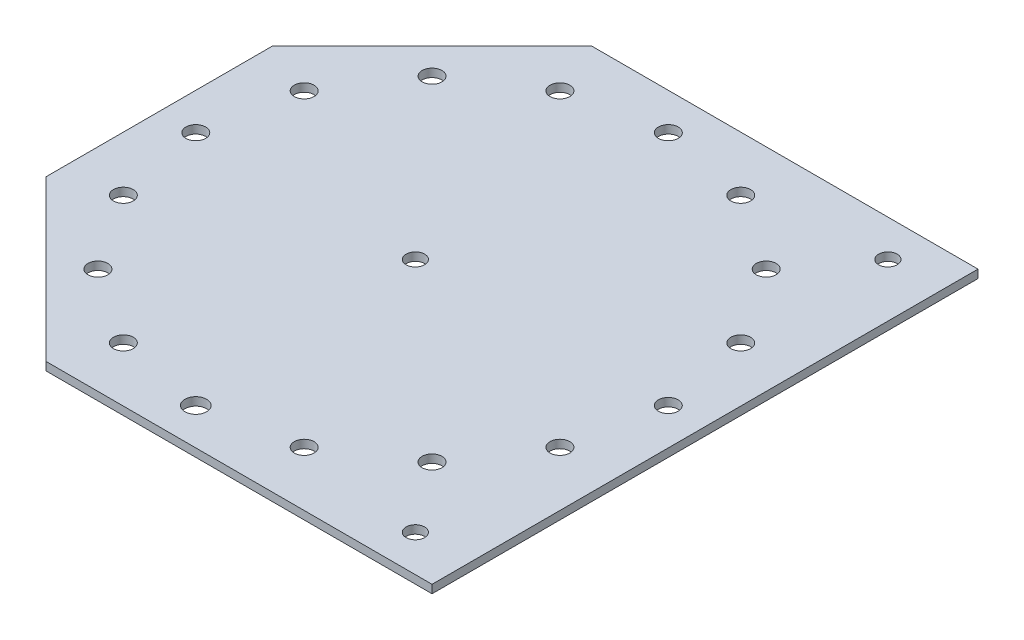
ISO-10303-21;
HEADER;
FILE_DESCRIPTION(('STEP AP214'),'2;1');
FILE_NAME('part.step','',(''),(''),'','','');
FILE_SCHEMA(('AUTOMOTIVE_DESIGN { 1 0 10303 214 1 1 1 1 }'));
ENDSEC;
DATA;
#1=APPLICATION_CONTEXT('core data for automotive mechanical design processes');
#2=APPLICATION_PROTOCOL_DEFINITION('international standard','automotive_design',2000,#1);
#3=PRODUCT_CONTEXT('',#1,'mechanical');
#4=PRODUCT('Part','Part','',(#3));
#5=PRODUCT_RELATED_PRODUCT_CATEGORY('part','',(#4));
#6=PRODUCT_DEFINITION_FORMATION('','',#4);
#7=PRODUCT_DEFINITION_CONTEXT('part definition',#1,'design');
#8=PRODUCT_DEFINITION('design','',#6,#7);
#9=PRODUCT_DEFINITION_SHAPE('','',#8);
#10=(LENGTH_UNIT() NAMED_UNIT(*) SI_UNIT(.MILLI.,.METRE.));
#11=(NAMED_UNIT(*) PLANE_ANGLE_UNIT() SI_UNIT($,.RADIAN.));
#12=(NAMED_UNIT(*) SI_UNIT($,.STERADIAN.) SOLID_ANGLE_UNIT());
#13=UNCERTAINTY_MEASURE_WITH_UNIT(LENGTH_MEASURE(1.E-05),#10,'distance_accuracy_value','');
#14=(GEOMETRIC_REPRESENTATION_CONTEXT(3) GLOBAL_UNCERTAINTY_ASSIGNED_CONTEXT((#13)) GLOBAL_UNIT_ASSIGNED_CONTEXT((#10,
#11,#12)) REPRESENTATION_CONTEXT('',''));
#15=CARTESIAN_POINT('',(0.,0.,0.));
#16=DIRECTION('',(0.,0.,1.));
#17=DIRECTION('',(1.,0.,0.));
#18=AXIS2_PLACEMENT_3D('',#15,#16,#17);
#19=CARTESIAN_POINT('',(-70.33237599072,3.,70.33237599072));
#20=DIRECTION('',(-0.707106781186548,0.,0.707106781186547));
#21=DIRECTION('',(0.707106781186547,0.,0.707106781186548));
#22=AXIS2_PLACEMENT_3D('',#19,#20,#21);
#23=PLANE('',#22);
#24=DIRECTION('',(-0.707106781186547,0.,-0.707106781186548));
#25=VECTOR('',#24,1.);
#26=CARTESIAN_POINT('',(-70.33237599072,0.,70.33237599072));
#27=LINE('',#26,#25);
#28=CARTESIAN_POINT('',(-41.1995242934893,0.,99.4652276879507));
#29=VERTEX_POINT('',#28);
#30=CARTESIAN_POINT('',(-99.4652276879507,0.,41.1995242934892));
#31=VERTEX_POINT('',#30);
#32=EDGE_CURVE('E177',#29,#31,#27,.T.);
#33=ORIENTED_EDGE('',*,*,#32,.F.);
#34=DIRECTION('',(0.,-1.,0.));
#35=VECTOR('',#34,1.);
#36=CARTESIAN_POINT('',(-41.1995242934893,3.,99.4652276879507));
#37=LINE('',#36,#35);
#38=CARTESIAN_POINT('',(-41.1995242934893,3.,99.4652276879507));
#39=VERTEX_POINT('',#38);
#40=EDGE_CURVE('E11',#39,#29,#37,.T.);
#41=ORIENTED_EDGE('',*,*,#40,.F.);
#42=DIRECTION('',(-0.707106781186547,0.,-0.707106781186548));
#43=VECTOR('',#42,1.);
#44=CARTESIAN_POINT('',(-70.33237599072,3.,70.33237599072));
#45=LINE('',#44,#43);
#46=CARTESIAN_POINT('',(-99.4652276879507,3.,41.1995242934892));
#47=VERTEX_POINT('',#46);
#48=EDGE_CURVE('E512',#39,#47,#45,.T.);
#49=ORIENTED_EDGE('',*,*,#48,.T.);
#50=DIRECTION('',(0.,-1.,0.));
#51=VECTOR('',#50,1.);
#52=CARTESIAN_POINT('',(-99.4652276879507,3.,41.1995242934892));
#53=LINE('',#52,#51);
#54=EDGE_CURVE('E80',#47,#31,#53,.T.);
#55=ORIENTED_EDGE('',*,*,#54,.T.);
#56=EDGE_LOOP('',(#33,#41,#49,#55));
#57=FACE_BOUND('',#56,.T.);
#58=ADVANCED_FACE('F34',(#57),#23,.T.);
#59=CARTESIAN_POINT('',(0.,3.,99.4652276879506));
#60=DIRECTION('',(0.,0.,-1.));
#61=DIRECTION('',(-1.,0.,0.));
#62=AXIS2_PLACEMENT_3D('',#59,#60,#61);
#63=PLANE('',#62);
#64=DIRECTION('',(1.,0.,0.));
#65=VECTOR('',#64,1.);
#66=CARTESIAN_POINT('',(0.,0.,99.4652276879506));
#67=LINE('',#66,#65);
#68=CARTESIAN_POINT('',(99.4652506094621,0.,99.4652276879506));
#69=VERTEX_POINT('',#68);
#70=EDGE_CURVE('E179',#29,#69,#67,.T.);
#71=ORIENTED_EDGE('',*,*,#70,.T.);
#72=DIRECTION('',(0.,-1.,0.));
#73=VECTOR('',#72,1.);
#74=CARTESIAN_POINT('',(99.4652506094621,3.,99.4652276879506));
#75=LINE('',#74,#73);
#76=CARTESIAN_POINT('',(99.4652506094621,3.,99.4652276879506));
#77=VERTEX_POINT('',#76);
#78=EDGE_CURVE('E43',#77,#69,#75,.T.);
#79=ORIENTED_EDGE('',*,*,#78,.F.);
#80=DIRECTION('',(1.,0.,0.));
#81=VECTOR('',#80,1.);
#82=CARTESIAN_POINT('',(0.,3.,99.4652276879506));
#83=LINE('',#82,#81);
#84=EDGE_CURVE('E115',#39,#77,#83,.T.);
#85=ORIENTED_EDGE('',*,*,#84,.F.);
#86=ORIENTED_EDGE('',*,*,#40,.T.);
#87=EDGE_LOOP('',(#71,#79,#85,#86));
#88=FACE_BOUND('',#87,.T.);
#89=ADVANCED_FACE('F198',(#88),#63,.F.);
#90=CARTESIAN_POINT('',(99.4652506094621,3.,0.));
#91=DIRECTION('',(-1.,0.,0.));
#92=DIRECTION('',(0.,0.,1.));
#93=AXIS2_PLACEMENT_3D('',#90,#91,#92);
#94=PLANE('',#93);
#95=DIRECTION('',(0.,0.,-1.));
#96=VECTOR('',#95,1.);
#97=CARTESIAN_POINT('',(99.4652506094621,0.,0.));
#98=LINE('',#97,#96);
#99=CARTESIAN_POINT('',(99.4652506094621,0.,-99.4652276879507));
#100=VERTEX_POINT('',#99);
#101=EDGE_CURVE('E182',#69,#100,#98,.T.);
#102=ORIENTED_EDGE('',*,*,#101,.T.);
#103=DIRECTION('',(0.,-1.,0.));
#104=VECTOR('',#103,1.);
#105=CARTESIAN_POINT('',(99.4652506094621,3.,-99.4652276879507));
#106=LINE('',#105,#104);
#107=CARTESIAN_POINT('',(99.4652506094621,3.,-99.4652276879507));
#108=VERTEX_POINT('',#107);
#109=EDGE_CURVE('E103',#108,#100,#106,.T.);
#110=ORIENTED_EDGE('',*,*,#109,.F.);
#111=DIRECTION('',(0.,0.,-1.));
#112=VECTOR('',#111,1.);
#113=CARTESIAN_POINT('',(99.4652506094621,3.,0.));
#114=LINE('',#113,#112);
#115=EDGE_CURVE('E112',#77,#108,#114,.T.);
#116=ORIENTED_EDGE('',*,*,#115,.F.);
#117=ORIENTED_EDGE('',*,*,#78,.T.);
#118=EDGE_LOOP('',(#102,#110,#116,#117));
#119=FACE_BOUND('',#118,.T.);
#120=ADVANCED_FACE('F195',(#119),#94,.F.);
#121=CARTESIAN_POINT('',(0.,3.,-99.4652276879507));
#122=DIRECTION('',(0.,0.,-1.));
#123=DIRECTION('',(-1.,0.,0.));
#124=AXIS2_PLACEMENT_3D('',#121,#122,#123);
#125=PLANE('',#124);
#126=DIRECTION('',(1.,0.,0.));
#127=VECTOR('',#126,1.);
#128=CARTESIAN_POINT('',(0.,0.,-99.4652276879507));
#129=LINE('',#128,#127);
#130=CARTESIAN_POINT('',(-41.1995242934893,0.,-99.4652276879507));
#131=VERTEX_POINT('',#130);
#132=EDGE_CURVE('E100',#131,#100,#129,.T.);
#133=ORIENTED_EDGE('',*,*,#132,.F.);
#134=DIRECTION('',(0.,-1.,0.));
#135=VECTOR('',#134,1.);
#136=CARTESIAN_POINT('',(-41.1995242934893,3.,-99.4652276879507));
#137=LINE('',#136,#135);
#138=CARTESIAN_POINT('',(-41.1995242934893,3.,-99.4652276879507));
#139=VERTEX_POINT('',#138);
#140=EDGE_CURVE('E94',#139,#131,#137,.T.);
#141=ORIENTED_EDGE('',*,*,#140,.F.);
#142=DIRECTION('',(1.,0.,0.));
#143=VECTOR('',#142,1.);
#144=CARTESIAN_POINT('',(0.,3.,-99.4652276879507));
#145=LINE('',#144,#143);
#146=EDGE_CURVE('E98',#139,#108,#145,.T.);
#147=ORIENTED_EDGE('',*,*,#146,.T.);
#148=ORIENTED_EDGE('',*,*,#109,.T.);
#149=EDGE_LOOP('',(#133,#141,#147,#148));
#150=FACE_BOUND('',#149,.T.);
#151=ADVANCED_FACE('F96',(#150),#125,.T.);
#152=CARTESIAN_POINT('',(-70.33237599072,3.,-70.33237599072));
#153=DIRECTION('',(0.707106781186548,0.,0.707106781186547));
#154=DIRECTION('',(0.707106781186547,0.,-0.707106781186548));
#155=AXIS2_PLACEMENT_3D('',#152,#153,#154);
#156=PLANE('',#155);
#157=DIRECTION('',(-0.707106781186547,0.,0.707106781186548));
#158=VECTOR('',#157,1.);
#159=CARTESIAN_POINT('',(-70.33237599072,0.,-70.33237599072));
#160=LINE('',#159,#158);
#161=CARTESIAN_POINT('',(-99.4652276879507,0.,-41.1995242934892));
#162=VERTEX_POINT('',#161);
#163=EDGE_CURVE('E186',#131,#162,#160,.T.);
#164=ORIENTED_EDGE('',*,*,#163,.T.);
#165=DIRECTION('',(0.,-1.,0.));
#166=VECTOR('',#165,1.);
#167=CARTESIAN_POINT('',(-99.4652276879507,3.,-41.1995242934892));
#168=LINE('',#167,#166);
#169=CARTESIAN_POINT('',(-99.4652276879507,3.,-41.1995242934892));
#170=VERTEX_POINT('',#169);
#171=EDGE_CURVE('E104',#170,#162,#168,.T.);
#172=ORIENTED_EDGE('',*,*,#171,.F.);
#173=DIRECTION('',(-0.707106781186547,0.,0.707106781186548));
#174=VECTOR('',#173,1.);
#175=CARTESIAN_POINT('',(-70.33237599072,3.,-70.33237599072));
#176=LINE('',#175,#174);
#177=EDGE_CURVE('E107',#139,#170,#176,.T.);
#178=ORIENTED_EDGE('',*,*,#177,.F.);
#179=ORIENTED_EDGE('',*,*,#140,.T.);
#180=EDGE_LOOP('',(#164,#172,#178,#179));
#181=FACE_BOUND('',#180,.T.);
#182=ADVANCED_FACE('F108',(#181),#156,.F.);
#183=CARTESIAN_POINT('',(0.,3.,86.0902506094622));
#184=DIRECTION('',(0.,-1.,0.));
#185=DIRECTION('',(0.,0.,-1.));
#186=AXIS2_PLACEMENT_3D('',#183,#184,#185);
#187=CYLINDRICAL_SURFACE('',#186,3.95112517832027);
#188=CARTESIAN_POINT('',(0.,3.,86.0902506094622));
#189=DIRECTION('',(0.,1.,0.));
#190=DIRECTION('',(0.,0.,1.));
#191=AXIS2_PLACEMENT_3D('',#188,#189,#190);
#192=CIRCLE('',#191,3.95112517832027);
#193=CARTESIAN_POINT('',(0.,3.,90.0413757877824));
#194=VERTEX_POINT('',#193);
#195=EDGE_CURVE('E513',#194,#194,#192,.T.);
#196=ORIENTED_EDGE('',*,*,#195,.T.);
#197=EDGE_LOOP('',(#196));
#198=FACE_BOUND('',#197,.T.);
#199=CARTESIAN_POINT('',(0.,0.,86.0902506094622));
#200=DIRECTION('',(0.,1.,0.));
#201=DIRECTION('',(0.,0.,1.));
#202=AXIS2_PLACEMENT_3D('',#199,#200,#201);
#203=CIRCLE('',#202,3.95112517832027);
#204=CARTESIAN_POINT('',(0.,0.,90.0413757877824));
#205=VERTEX_POINT('',#204);
#206=EDGE_CURVE('E174',#205,#205,#203,.T.);
#207=ORIENTED_EDGE('',*,*,#206,.F.);
#208=EDGE_LOOP('',(#207));
#209=FACE_BOUND('',#208,.T.);
#210=ADVANCED_FACE('F208',(#198,#209),#187,.F.);
#211=CARTESIAN_POINT('',(-86.0902506094622,3.,0.));
#212=DIRECTION('',(0.,-1.,0.));
#213=DIRECTION('',(0.,0.,-1.));
#214=AXIS2_PLACEMENT_3D('',#211,#212,#213);
#215=CYLINDRICAL_SURFACE('',#214,3.60694572217642);
#216=CARTESIAN_POINT('',(-86.0902506094622,3.,0.));
#217=DIRECTION('',(0.,1.,0.));
#218=DIRECTION('',(0.,0.,1.));
#219=AXIS2_PLACEMENT_3D('',#216,#217,#218);
#220=CIRCLE('',#219,3.60694572217642);
#221=CARTESIAN_POINT('',(-86.0902506094622,3.,3.60694572217642));
#222=VERTEX_POINT('',#221);
#223=EDGE_CURVE('E516',#222,#222,#220,.T.);
#224=ORIENTED_EDGE('',*,*,#223,.T.);
#225=EDGE_LOOP('',(#224));
#226=FACE_BOUND('',#225,.T.);
#227=CARTESIAN_POINT('',(-86.0902506094622,0.,0.));
#228=DIRECTION('',(0.,1.,0.));
#229=DIRECTION('',(0.,0.,1.));
#230=AXIS2_PLACEMENT_3D('',#227,#228,#229);
#231=CIRCLE('',#230,3.60694572217642);
#232=CARTESIAN_POINT('',(-86.0902506094622,0.,3.60694572217642));
#233=VERTEX_POINT('',#232);
#234=EDGE_CURVE('E171',#233,#233,#231,.T.);
#235=ORIENTED_EDGE('',*,*,#234,.F.);
#236=EDGE_LOOP('',(#235));
#237=FACE_BOUND('',#236,.T.);
#238=ADVANCED_FACE('F211',(#226,#237),#215,.F.);
#239=CARTESIAN_POINT('',(-79.5370204868494,3.,-32.9453125963998));
#240=DIRECTION('',(0.,-1.,0.));
#241=DIRECTION('',(0.,0.,-1.));
#242=AXIS2_PLACEMENT_3D('',#239,#240,#241);
#243=CYLINDRICAL_SURFACE('',#242,3.60694572217643);
#244=CARTESIAN_POINT('',(-79.5370204868494,3.,-32.9453125963998));
#245=DIRECTION('',(0.,1.,0.));
#246=DIRECTION('',(0.,0.,1.));
#247=AXIS2_PLACEMENT_3D('',#244,#245,#246);
#248=CIRCLE('',#247,3.60694572217643);
#249=CARTESIAN_POINT('',(-79.5370204868494,3.,-29.3383668742234));
#250=VERTEX_POINT('',#249);
#251=EDGE_CURVE('E521',#250,#250,#248,.T.);
#252=ORIENTED_EDGE('',*,*,#251,.T.);
#253=EDGE_LOOP('',(#252));
#254=FACE_BOUND('',#253,.T.);
#255=CARTESIAN_POINT('',(-79.5370204868494,0.,-32.9453125963998));
#256=DIRECTION('',(0.,1.,0.));
#257=DIRECTION('',(0.,0.,1.));
#258=AXIS2_PLACEMENT_3D('',#255,#256,#257);
#259=CIRCLE('',#258,3.60694572217643);
#260=CARTESIAN_POINT('',(-79.5370204868494,0.,-29.3383668742234));
#261=VERTEX_POINT('',#260);
#262=EDGE_CURVE('E168',#261,#261,#259,.T.);
#263=ORIENTED_EDGE('',*,*,#262,.F.);
#264=EDGE_LOOP('',(#263));
#265=FACE_BOUND('',#264,.T.);
#266=ADVANCED_FACE('F215',(#254,#265),#243,.F.);
#267=CARTESIAN_POINT('',(-60.8749999999999,3.,-60.8750000000001));
#268=DIRECTION('',(0.,-1.,0.));
#269=DIRECTION('',(0.,0.,-1.));
#270=AXIS2_PLACEMENT_3D('',#267,#268,#269);
#271=CYLINDRICAL_SURFACE('',#270,3.60694572217643);
#272=CARTESIAN_POINT('',(-60.8749999999999,3.,-60.8750000000001));
#273=DIRECTION('',(0.,1.,0.));
#274=DIRECTION('',(0.,0.,1.));
#275=AXIS2_PLACEMENT_3D('',#272,#273,#274);
#276=CIRCLE('',#275,3.60694572217643);
#277=CARTESIAN_POINT('',(-60.8749999999999,3.,-57.2680542778237));
#278=VERTEX_POINT('',#277);
#279=EDGE_CURVE('E524',#278,#278,#276,.T.);
#280=ORIENTED_EDGE('',*,*,#279,.T.);
#281=EDGE_LOOP('',(#280));
#282=FACE_BOUND('',#281,.T.);
#283=CARTESIAN_POINT('',(-60.8749999999999,0.,-60.8750000000001));
#284=DIRECTION('',(0.,1.,0.));
#285=DIRECTION('',(0.,0.,1.));
#286=AXIS2_PLACEMENT_3D('',#283,#284,#285);
#287=CIRCLE('',#286,3.60694572217643);
#288=CARTESIAN_POINT('',(-60.8749999999999,0.,-57.2680542778237));
#289=VERTEX_POINT('',#288);
#290=EDGE_CURVE('E165',#289,#289,#287,.T.);
#291=ORIENTED_EDGE('',*,*,#290,.F.);
#292=EDGE_LOOP('',(#291));
#293=FACE_BOUND('',#292,.T.);
#294=ADVANCED_FACE('F219',(#282,#293),#271,.F.);
#295=CARTESIAN_POINT('',(-32.9453125963995,3.,-79.5370204868495));
#296=DIRECTION('',(0.,-1.,0.));
#297=DIRECTION('',(0.,0.,-1.));
#298=AXIS2_PLACEMENT_3D('',#295,#296,#297);
#299=CYLINDRICAL_SURFACE('',#298,3.60694572217643);
#300=CARTESIAN_POINT('',(-32.9453125963995,3.,-79.5370204868495));
#301=DIRECTION('',(0.,1.,0.));
#302=DIRECTION('',(0.,0.,1.));
#303=AXIS2_PLACEMENT_3D('',#300,#301,#302);
#304=CIRCLE('',#303,3.60694572217643);
#305=CARTESIAN_POINT('',(-32.9453125963995,3.,-75.9300747646731));
#306=VERTEX_POINT('',#305);
#307=EDGE_CURVE('E527',#306,#306,#304,.T.);
#308=ORIENTED_EDGE('',*,*,#307,.T.);
#309=EDGE_LOOP('',(#308));
#310=FACE_BOUND('',#309,.T.);
#311=CARTESIAN_POINT('',(-32.9453125963995,0.,-79.5370204868495));
#312=DIRECTION('',(0.,1.,0.));
#313=DIRECTION('',(0.,0.,1.));
#314=AXIS2_PLACEMENT_3D('',#311,#312,#313);
#315=CIRCLE('',#314,3.60694572217643);
#316=CARTESIAN_POINT('',(-32.9453125963995,0.,-75.9300747646731));
#317=VERTEX_POINT('',#316);
#318=EDGE_CURVE('E162',#317,#317,#315,.T.);
#319=ORIENTED_EDGE('',*,*,#318,.F.);
#320=EDGE_LOOP('',(#319));
#321=FACE_BOUND('',#320,.T.);
#322=ADVANCED_FACE('F223',(#310,#321),#299,.F.);
#323=CARTESIAN_POINT('',(3.00582503459266E-13,3.,-86.0902506094621));
#324=DIRECTION('',(0.,-1.,0.));
#325=DIRECTION('',(0.,0.,-1.));
#326=AXIS2_PLACEMENT_3D('',#323,#324,#325);
#327=CYLINDRICAL_SURFACE('',#326,3.60694572217642);
#328=CARTESIAN_POINT('',(3.00582503459266E-13,3.,-86.0902506094621));
#329=DIRECTION('',(0.,1.,0.));
#330=DIRECTION('',(0.,0.,1.));
#331=AXIS2_PLACEMENT_3D('',#328,#329,#330);
#332=CIRCLE('',#331,3.60694572217642);
#333=CARTESIAN_POINT('',(3.00582503459266E-13,3.,-82.4833048872857));
#334=VERTEX_POINT('',#333);
#335=EDGE_CURVE('E530',#334,#334,#332,.T.);
#336=ORIENTED_EDGE('',*,*,#335,.T.);
#337=EDGE_LOOP('',(#336));
#338=FACE_BOUND('',#337,.T.);
#339=CARTESIAN_POINT('',(3.00582503459266E-13,0.,-86.0902506094621));
#340=DIRECTION('',(0.,1.,0.));
#341=DIRECTION('',(0.,0.,1.));
#342=AXIS2_PLACEMENT_3D('',#339,#340,#341);
#343=CIRCLE('',#342,3.60694572217642);
#344=CARTESIAN_POINT('',(3.00582503459266E-13,0.,-82.4833048872857));
#345=VERTEX_POINT('',#344);
#346=EDGE_CURVE('E159',#345,#345,#343,.T.);
#347=ORIENTED_EDGE('',*,*,#346,.F.);
#348=EDGE_LOOP('',(#347));
#349=FACE_BOUND('',#348,.T.);
#350=ADVANCED_FACE('F227',(#338,#349),#327,.F.);
#351=CARTESIAN_POINT('',(32.9453125964001,3.,-79.5370204868493));
#352=DIRECTION('',(0.,-1.,0.));
#353=DIRECTION('',(0.,0.,-1.));
#354=AXIS2_PLACEMENT_3D('',#351,#352,#353);
#355=CYLINDRICAL_SURFACE('',#354,3.60694572217642);
#356=CARTESIAN_POINT('',(32.9453125964001,3.,-79.5370204868493));
#357=DIRECTION('',(0.,1.,0.));
#358=DIRECTION('',(0.,0.,1.));
#359=AXIS2_PLACEMENT_3D('',#356,#357,#358);
#360=CIRCLE('',#359,3.60694572217642);
#361=CARTESIAN_POINT('',(32.9453125964001,3.,-75.9300747646729));
#362=VERTEX_POINT('',#361);
#363=EDGE_CURVE('E533',#362,#362,#360,.T.);
#364=ORIENTED_EDGE('',*,*,#363,.T.);
#365=EDGE_LOOP('',(#364));
#366=FACE_BOUND('',#365,.T.);
#367=CARTESIAN_POINT('',(32.9453125964001,0.,-79.5370204868493));
#368=DIRECTION('',(0.,1.,0.));
#369=DIRECTION('',(0.,0.,1.));
#370=AXIS2_PLACEMENT_3D('',#367,#368,#369);
#371=CIRCLE('',#370,3.60694572217642);
#372=CARTESIAN_POINT('',(32.9453125964001,0.,-75.9300747646729));
#373=VERTEX_POINT('',#372);
#374=EDGE_CURVE('E156',#373,#373,#371,.T.);
#375=ORIENTED_EDGE('',*,*,#374,.F.);
#376=EDGE_LOOP('',(#375));
#377=FACE_BOUND('',#376,.T.);
#378=ADVANCED_FACE('F231',(#366,#377),#355,.F.);
#379=CARTESIAN_POINT('',(60.8750000000003,3.,-60.8749999999997));
#380=DIRECTION('',(0.,-1.,0.));
#381=DIRECTION('',(0.,0.,-1.));
#382=AXIS2_PLACEMENT_3D('',#379,#380,#381);
#383=CYLINDRICAL_SURFACE('',#382,3.60694572217642);
#384=CARTESIAN_POINT('',(60.8750000000003,3.,-60.8749999999997));
#385=DIRECTION('',(0.,1.,0.));
#386=DIRECTION('',(0.,0.,1.));
#387=AXIS2_PLACEMENT_3D('',#384,#385,#386);
#388=CIRCLE('',#387,3.60694572217642);
#389=CARTESIAN_POINT('',(60.8750000000003,3.,-57.2680542778232));
#390=VERTEX_POINT('',#389);
#391=EDGE_CURVE('E536',#390,#390,#388,.T.);
#392=ORIENTED_EDGE('',*,*,#391,.T.);
#393=EDGE_LOOP('',(#392));
#394=FACE_BOUND('',#393,.T.);
#395=CARTESIAN_POINT('',(60.8750000000003,0.,-60.8749999999997));
#396=DIRECTION('',(0.,1.,0.));
#397=DIRECTION('',(0.,0.,1.));
#398=AXIS2_PLACEMENT_3D('',#395,#396,#397);
#399=CIRCLE('',#398,3.60694572217642);
#400=CARTESIAN_POINT('',(60.8750000000003,0.,-57.2680542778232));
#401=VERTEX_POINT('',#400);
#402=EDGE_CURVE('E153',#401,#401,#399,.T.);
#403=ORIENTED_EDGE('',*,*,#402,.F.);
#404=EDGE_LOOP('',(#403));
#405=FACE_BOUND('',#404,.T.);
#406=ADVANCED_FACE('F235',(#394,#405),#383,.F.);
#407=CARTESIAN_POINT('',(79.5370204868496,3.,-32.9453125963993));
#408=DIRECTION('',(0.,-1.,0.));
#409=DIRECTION('',(0.,0.,-1.));
#410=AXIS2_PLACEMENT_3D('',#407,#408,#409);
#411=CYLINDRICAL_SURFACE('',#410,3.60694572217642);
#412=CARTESIAN_POINT('',(79.5370204868496,3.,-32.9453125963993));
#413=DIRECTION('',(0.,1.,0.));
#414=DIRECTION('',(0.,0.,1.));
#415=AXIS2_PLACEMENT_3D('',#412,#413,#414);
#416=CIRCLE('',#415,3.60694572217642);
#417=CARTESIAN_POINT('',(79.5370204868496,3.,-29.3383668742228));
#418=VERTEX_POINT('',#417);
#419=EDGE_CURVE('E539',#418,#418,#416,.T.);
#420=ORIENTED_EDGE('',*,*,#419,.T.);
#421=EDGE_LOOP('',(#420));
#422=FACE_BOUND('',#421,.T.);
#423=CARTESIAN_POINT('',(79.5370204868496,0.,-32.9453125963993));
#424=DIRECTION('',(0.,1.,0.));
#425=DIRECTION('',(0.,0.,1.));
#426=AXIS2_PLACEMENT_3D('',#423,#424,#425);
#427=CIRCLE('',#426,3.60694572217642);
#428=CARTESIAN_POINT('',(79.5370204868496,0.,-29.3383668742228));
#429=VERTEX_POINT('',#428);
#430=EDGE_CURVE('E150',#429,#429,#427,.T.);
#431=ORIENTED_EDGE('',*,*,#430,.F.);
#432=EDGE_LOOP('',(#431));
#433=FACE_BOUND('',#432,.T.);
#434=ADVANCED_FACE('F239',(#422,#433),#411,.F.);
#435=CARTESIAN_POINT('',(86.0902506094622,3.,6.01165006918532E-13));
#436=DIRECTION('',(0.,-1.,0.));
#437=DIRECTION('',(0.,0.,-1.));
#438=AXIS2_PLACEMENT_3D('',#435,#436,#437);
#439=CYLINDRICAL_SURFACE('',#438,3.60694572217643);
#440=CARTESIAN_POINT('',(86.0902506094622,3.,6.01165006918532E-13));
#441=DIRECTION('',(0.,1.,0.));
#442=DIRECTION('',(0.,0.,1.));
#443=AXIS2_PLACEMENT_3D('',#440,#441,#442);
#444=CIRCLE('',#443,3.60694572217643);
#445=CARTESIAN_POINT('',(86.0902506094622,3.,3.60694572217703));
#446=VERTEX_POINT('',#445);
#447=EDGE_CURVE('E542',#446,#446,#444,.T.);
#448=ORIENTED_EDGE('',*,*,#447,.T.);
#449=EDGE_LOOP('',(#448));
#450=FACE_BOUND('',#449,.T.);
#451=CARTESIAN_POINT('',(86.0902506094622,0.,6.01165006918532E-13));
#452=DIRECTION('',(0.,1.,0.));
#453=DIRECTION('',(0.,0.,1.));
#454=AXIS2_PLACEMENT_3D('',#451,#452,#453);
#455=CIRCLE('',#454,3.60694572217643);
#456=CARTESIAN_POINT('',(86.0902506094622,0.,3.60694572217703));
#457=VERTEX_POINT('',#456);
#458=EDGE_CURVE('E147',#457,#457,#455,.T.);
#459=ORIENTED_EDGE('',*,*,#458,.F.);
#460=EDGE_LOOP('',(#459));
#461=FACE_BOUND('',#460,.T.);
#462=ADVANCED_FACE('F243',(#450,#461),#439,.F.);
#463=CARTESIAN_POINT('',(79.5370204868492,3.,32.9453125964004));
#464=DIRECTION('',(0.,-1.,0.));
#465=DIRECTION('',(0.,0.,-1.));
#466=AXIS2_PLACEMENT_3D('',#463,#464,#465);
#467=CYLINDRICAL_SURFACE('',#466,3.60694572217643);
#468=CARTESIAN_POINT('',(79.5370204868492,3.,32.9453125964004));
#469=DIRECTION('',(0.,1.,0.));
#470=DIRECTION('',(0.,0.,1.));
#471=AXIS2_PLACEMENT_3D('',#468,#469,#470);
#472=CIRCLE('',#471,3.60694572217643);
#473=CARTESIAN_POINT('',(79.5370204868492,3.,36.5522583185768));
#474=VERTEX_POINT('',#473);
#475=EDGE_CURVE('E545',#474,#474,#472,.T.);
#476=ORIENTED_EDGE('',*,*,#475,.T.);
#477=EDGE_LOOP('',(#476));
#478=FACE_BOUND('',#477,.T.);
#479=CARTESIAN_POINT('',(79.5370204868492,0.,32.9453125964004));
#480=DIRECTION('',(0.,1.,0.));
#481=DIRECTION('',(0.,0.,1.));
#482=AXIS2_PLACEMENT_3D('',#479,#480,#481);
#483=CIRCLE('',#482,3.60694572217643);
#484=CARTESIAN_POINT('',(79.5370204868492,0.,36.5522583185768));
#485=VERTEX_POINT('',#484);
#486=EDGE_CURVE('E144',#485,#485,#483,.T.);
#487=ORIENTED_EDGE('',*,*,#486,.F.);
#488=EDGE_LOOP('',(#487));
#489=FACE_BOUND('',#488,.T.);
#490=ADVANCED_FACE('F247',(#478,#489),#467,.F.);
#491=CARTESIAN_POINT('',(60.8749999999995,3.,60.8750000000005));
#492=DIRECTION('',(0.,-1.,0.));
#493=DIRECTION('',(0.,0.,-1.));
#494=AXIS2_PLACEMENT_3D('',#491,#492,#493);
#495=CYLINDRICAL_SURFACE('',#494,3.60694572217642);
#496=CARTESIAN_POINT('',(60.8749999999995,3.,60.8750000000005));
#497=DIRECTION('',(0.,1.,0.));
#498=DIRECTION('',(0.,0.,1.));
#499=AXIS2_PLACEMENT_3D('',#496,#497,#498);
#500=CIRCLE('',#499,3.60694572217642);
#501=CARTESIAN_POINT('',(60.8749999999995,3.,64.4819457221769));
#502=VERTEX_POINT('',#501);
#503=EDGE_CURVE('E548',#502,#502,#500,.T.);
#504=ORIENTED_EDGE('',*,*,#503,.T.);
#505=EDGE_LOOP('',(#504));
#506=FACE_BOUND('',#505,.T.);
#507=CARTESIAN_POINT('',(60.8749999999995,0.,60.8750000000005));
#508=DIRECTION('',(0.,1.,0.));
#509=DIRECTION('',(0.,0.,1.));
#510=AXIS2_PLACEMENT_3D('',#507,#508,#509);
#511=CIRCLE('',#510,3.60694572217642);
#512=CARTESIAN_POINT('',(60.8749999999995,0.,64.4819457221769));
#513=VERTEX_POINT('',#512);
#514=EDGE_CURVE('E141',#513,#513,#511,.T.);
#515=ORIENTED_EDGE('',*,*,#514,.F.);
#516=EDGE_LOOP('',(#515));
#517=FACE_BOUND('',#516,.T.);
#518=ADVANCED_FACE('F251',(#506,#517),#495,.F.);
#519=CARTESIAN_POINT('',(32.9453125963989,3.,79.5370204868498));
#520=DIRECTION('',(0.,-1.,0.));
#521=DIRECTION('',(0.,0.,-1.));
#522=AXIS2_PLACEMENT_3D('',#519,#520,#521);
#523=CYLINDRICAL_SURFACE('',#522,3.60694572217643);
#524=CARTESIAN_POINT('',(32.9453125963989,3.,79.5370204868498));
#525=DIRECTION('',(0.,1.,0.));
#526=DIRECTION('',(0.,0.,1.));
#527=AXIS2_PLACEMENT_3D('',#524,#525,#526);
#528=CIRCLE('',#527,3.60694572217643);
#529=CARTESIAN_POINT('',(32.9453125963989,3.,83.1439662090262));
#530=VERTEX_POINT('',#529);
#531=EDGE_CURVE('E551',#530,#530,#528,.T.);
#532=ORIENTED_EDGE('',*,*,#531,.T.);
#533=EDGE_LOOP('',(#532));
#534=FACE_BOUND('',#533,.T.);
#535=CARTESIAN_POINT('',(32.9453125963989,0.,79.5370204868498));
#536=DIRECTION('',(0.,1.,0.));
#537=DIRECTION('',(0.,0.,1.));
#538=AXIS2_PLACEMENT_3D('',#535,#536,#537);
#539=CIRCLE('',#538,3.60694572217643);
#540=CARTESIAN_POINT('',(32.9453125963989,0.,83.1439662090262));
#541=VERTEX_POINT('',#540);
#542=EDGE_CURVE('E138',#541,#541,#539,.T.);
#543=ORIENTED_EDGE('',*,*,#542,.F.);
#544=EDGE_LOOP('',(#543));
#545=FACE_BOUND('',#544,.T.);
#546=ADVANCED_FACE('F255',(#534,#545),#523,.F.);
#547=CARTESIAN_POINT('',(-32.9453125964006,3.,79.5370204868491));
#548=DIRECTION('',(0.,-1.,0.));
#549=DIRECTION('',(0.,0.,-1.));
#550=AXIS2_PLACEMENT_3D('',#547,#548,#549);
#551=CYLINDRICAL_SURFACE('',#550,3.60694572217644);
#552=CARTESIAN_POINT('',(-32.9453125964006,3.,79.5370204868491));
#553=DIRECTION('',(0.,1.,0.));
#554=DIRECTION('',(0.,0.,1.));
#555=AXIS2_PLACEMENT_3D('',#552,#553,#554);
#556=CIRCLE('',#555,3.60694572217644);
#557=CARTESIAN_POINT('',(-32.9453125964006,3.,83.1439662090255));
#558=VERTEX_POINT('',#557);
#559=EDGE_CURVE('E554',#558,#558,#556,.T.);
#560=ORIENTED_EDGE('',*,*,#559,.T.);
#561=EDGE_LOOP('',(#560));
#562=FACE_BOUND('',#561,.T.);
#563=CARTESIAN_POINT('',(-32.9453125964006,0.,79.5370204868491));
#564=DIRECTION('',(0.,1.,0.));
#565=DIRECTION('',(0.,0.,1.));
#566=AXIS2_PLACEMENT_3D('',#563,#564,#565);
#567=CIRCLE('',#566,3.60694572217644);
#568=CARTESIAN_POINT('',(-32.9453125964006,0.,83.1439662090255));
#569=VERTEX_POINT('',#568);
#570=EDGE_CURVE('E135',#569,#569,#567,.T.);
#571=ORIENTED_EDGE('',*,*,#570,.F.);
#572=EDGE_LOOP('',(#571));
#573=FACE_BOUND('',#572,.T.);
#574=ADVANCED_FACE('F259',(#562,#573),#551,.F.);
#575=CARTESIAN_POINT('',(-60.8750000000007,3.,60.8749999999993));
#576=DIRECTION('',(0.,-1.,0.));
#577=DIRECTION('',(0.,0.,-1.));
#578=AXIS2_PLACEMENT_3D('',#575,#576,#577);
#579=CYLINDRICAL_SURFACE('',#578,3.60694572217643);
#580=CARTESIAN_POINT('',(-60.8750000000007,3.,60.8749999999993));
#581=DIRECTION('',(0.,1.,0.));
#582=DIRECTION('',(0.,0.,1.));
#583=AXIS2_PLACEMENT_3D('',#580,#581,#582);
#584=CIRCLE('',#583,3.60694572217643);
#585=CARTESIAN_POINT('',(-60.8750000000007,3.,64.4819457221757));
#586=VERTEX_POINT('',#585);
#587=EDGE_CURVE('E557',#586,#586,#584,.T.);
#588=ORIENTED_EDGE('',*,*,#587,.T.);
#589=EDGE_LOOP('',(#588));
#590=FACE_BOUND('',#589,.T.);
#591=CARTESIAN_POINT('',(-60.8750000000007,0.,60.8749999999993));
#592=DIRECTION('',(0.,1.,0.));
#593=DIRECTION('',(0.,0.,1.));
#594=AXIS2_PLACEMENT_3D('',#591,#592,#593);
#595=CIRCLE('',#594,3.60694572217643);
#596=CARTESIAN_POINT('',(-60.8750000000007,0.,64.4819457221757));
#597=VERTEX_POINT('',#596);
#598=EDGE_CURVE('E132',#597,#597,#595,.T.);
#599=ORIENTED_EDGE('',*,*,#598,.F.);
#600=EDGE_LOOP('',(#599));
#601=FACE_BOUND('',#600,.T.);
#602=ADVANCED_FACE('F263',(#590,#601),#579,.F.);
#603=CARTESIAN_POINT('',(-79.5370204868499,3.,32.9453125963987));
#604=DIRECTION('',(0.,-1.,0.));
#605=DIRECTION('',(0.,0.,-1.));
#606=AXIS2_PLACEMENT_3D('',#603,#604,#605);
#607=CYLINDRICAL_SURFACE('',#606,3.60694572217643);
#608=CARTESIAN_POINT('',(-79.5370204868499,3.,32.9453125963987));
#609=DIRECTION('',(0.,1.,0.));
#610=DIRECTION('',(0.,0.,1.));
#611=AXIS2_PLACEMENT_3D('',#608,#609,#610);
#612=CIRCLE('',#611,3.60694572217643);
#613=CARTESIAN_POINT('',(-79.5370204868499,3.,36.5522583185751));
#614=VERTEX_POINT('',#613);
#615=EDGE_CURVE('E560',#614,#614,#612,.T.);
#616=ORIENTED_EDGE('',*,*,#615,.T.);
#617=EDGE_LOOP('',(#616));
#618=FACE_BOUND('',#617,.T.);
#619=CARTESIAN_POINT('',(-79.5370204868499,0.,32.9453125963987));
#620=DIRECTION('',(0.,1.,0.));
#621=DIRECTION('',(0.,0.,1.));
#622=AXIS2_PLACEMENT_3D('',#619,#620,#621);
#623=CIRCLE('',#622,3.60694572217643);
#624=CARTESIAN_POINT('',(-79.5370204868499,0.,36.5522583185751));
#625=VERTEX_POINT('',#624);
#626=EDGE_CURVE('E129',#625,#625,#623,.T.);
#627=ORIENTED_EDGE('',*,*,#626,.F.);
#628=EDGE_LOOP('',(#627));
#629=FACE_BOUND('',#628,.T.);
#630=ADVANCED_FACE('F267',(#618,#629),#607,.F.);
#631=CARTESIAN_POINT('',(80.0047500609787,3.,86.0902499390213));
#632=DIRECTION('',(0.,-1.,0.));
#633=DIRECTION('',(0.,0.,-1.));
#634=AXIS2_PLACEMENT_3D('',#631,#632,#633);
#635=CYLINDRICAL_SURFACE('',#634,3.37500000187563);
#636=CARTESIAN_POINT('',(80.0047500609787,3.,86.0902499390213));
#637=DIRECTION('',(0.,1.,0.));
#638=DIRECTION('',(0.,0.,1.));
#639=AXIS2_PLACEMENT_3D('',#636,#637,#638);
#640=CIRCLE('',#639,3.37500000187563);
#641=CARTESIAN_POINT('',(80.0047500609787,3.,89.4652499408969));
#642=VERTEX_POINT('',#641);
#643=EDGE_CURVE('E563',#642,#642,#640,.T.);
#644=ORIENTED_EDGE('',*,*,#643,.T.);
#645=EDGE_LOOP('',(#644));
#646=FACE_BOUND('',#645,.T.);
#647=CARTESIAN_POINT('',(80.0047500609787,0.,86.0902499390213));
#648=DIRECTION('',(0.,1.,0.));
#649=DIRECTION('',(0.,0.,1.));
#650=AXIS2_PLACEMENT_3D('',#647,#648,#649);
#651=CIRCLE('',#650,3.37500000187563);
#652=CARTESIAN_POINT('',(80.0047500609787,0.,89.4652499408969));
#653=VERTEX_POINT('',#652);
#654=EDGE_CURVE('E126',#653,#653,#651,.T.);
#655=ORIENTED_EDGE('',*,*,#654,.F.);
#656=EDGE_LOOP('',(#655));
#657=FACE_BOUND('',#656,.T.);
#658=ADVANCED_FACE('F271',(#646,#657),#635,.F.);
#659=CARTESIAN_POINT('',(-6.08550054848303,3.,-6.70440363824496E-07));
#660=DIRECTION('',(0.,-1.,0.));
#661=DIRECTION('',(0.,0.,-1.));
#662=AXIS2_PLACEMENT_3D('',#659,#660,#661);
#663=CYLINDRICAL_SURFACE('',#662,3.37500000129891);
#664=CARTESIAN_POINT('',(-6.08550054848303,3.,-6.70440363824496E-07));
#665=DIRECTION('',(0.,1.,0.));
#666=DIRECTION('',(0.,0.,1.));
#667=AXIS2_PLACEMENT_3D('',#664,#665,#666);
#668=CIRCLE('',#667,3.37500000129891);
#669=CARTESIAN_POINT('',(-6.08550054848303,3.,3.37499933085854));
#670=VERTEX_POINT('',#669);
#671=EDGE_CURVE('E286',#670,#670,#668,.T.);
#672=ORIENTED_EDGE('',*,*,#671,.T.);
#673=EDGE_LOOP('',(#672));
#674=FACE_BOUND('',#673,.T.);
#675=CARTESIAN_POINT('',(-6.08550054848303,0.,-6.70440363824496E-07));
#676=DIRECTION('',(0.,1.,0.));
#677=DIRECTION('',(0.,0.,1.));
#678=AXIS2_PLACEMENT_3D('',#675,#676,#677);
#679=CIRCLE('',#678,3.37500000129891);
#680=CARTESIAN_POINT('',(-6.08550054848303,0.,3.37499933085854));
#681=VERTEX_POINT('',#680);
#682=EDGE_CURVE('E123',#681,#681,#679,.T.);
#683=ORIENTED_EDGE('',*,*,#682,.F.);
#684=EDGE_LOOP('',(#683));
#685=FACE_BOUND('',#684,.T.);
#686=ADVANCED_FACE('F274',(#674,#685),#663,.F.);
#687=CARTESIAN_POINT('',(80.0047500609787,3.,-86.0902512799021));
#688=DIRECTION('',(0.,-1.,0.));
#689=DIRECTION('',(0.,0.,-1.));
#690=AXIS2_PLACEMENT_3D('',#687,#688,#689);
#691=CYLINDRICAL_SURFACE('',#690,3.37499999942943);
#692=CARTESIAN_POINT('',(80.0047500609787,3.,-86.0902512799021));
#693=DIRECTION('',(0.,1.,0.));
#694=DIRECTION('',(0.,0.,1.));
#695=AXIS2_PLACEMENT_3D('',#692,#693,#694);
#696=CIRCLE('',#695,3.37499999942943);
#697=CARTESIAN_POINT('',(80.0047500609787,3.,-82.7152512804727));
#698=VERTEX_POINT('',#697);
#699=EDGE_CURVE('E189',#698,#698,#696,.T.);
#700=ORIENTED_EDGE('',*,*,#699,.T.);
#701=EDGE_LOOP('',(#700));
#702=FACE_BOUND('',#701,.T.);
#703=CARTESIAN_POINT('',(80.0047500609787,0.,-86.0902512799021));
#704=DIRECTION('',(0.,1.,0.));
#705=DIRECTION('',(0.,0.,1.));
#706=AXIS2_PLACEMENT_3D('',#703,#704,#705);
#707=CIRCLE('',#706,3.37499999942943);
#708=CARTESIAN_POINT('',(80.0047500609787,0.,-82.7152512804727));
#709=VERTEX_POINT('',#708);
#710=EDGE_CURVE('E120',#709,#709,#707,.T.);
#711=ORIENTED_EDGE('',*,*,#710,.F.);
#712=EDGE_LOOP('',(#711));
#713=FACE_BOUND('',#712,.T.);
#714=ADVANCED_FACE('F36',(#702,#713),#691,.F.);
#715=CARTESIAN_POINT('',(-99.4652276879507,3.,0.));
#716=DIRECTION('',(1.,0.,0.));
#717=DIRECTION('',(0.,0.,-1.));
#718=AXIS2_PLACEMENT_3D('',#715,#716,#717);
#719=PLANE('',#718);
#720=DIRECTION('',(0.,0.,1.));
#721=VECTOR('',#720,1.);
#722=CARTESIAN_POINT('',(-99.4652276879507,0.,0.));
#723=LINE('',#722,#721);
#724=EDGE_CURVE('E73',#162,#31,#723,.T.);
#725=ORIENTED_EDGE('',*,*,#724,.T.);
#726=ORIENTED_EDGE('',*,*,#54,.F.);
#727=DIRECTION('',(0.,0.,1.));
#728=VECTOR('',#727,1.);
#729=CARTESIAN_POINT('',(-99.4652276879507,3.,0.));
#730=LINE('',#729,#728);
#731=EDGE_CURVE('E51',#170,#47,#730,.T.);
#732=ORIENTED_EDGE('',*,*,#731,.F.);
#733=ORIENTED_EDGE('',*,*,#171,.T.);
#734=EDGE_LOOP('',(#725,#726,#732,#733));
#735=FACE_BOUND('',#734,.T.);
#736=ADVANCED_FACE('F281',(#735),#719,.F.);
#737=CARTESIAN_POINT('',(0.,3.,0.));
#738=DIRECTION('',(0.,1.,0.));
#739=DIRECTION('',(0.,0.,1.));
#740=AXIS2_PLACEMENT_3D('',#737,#738,#739);
#741=PLANE('',#740);
#742=ORIENTED_EDGE('',*,*,#699,.F.);
#743=EDGE_LOOP('',(#742));
#744=FACE_BOUND('',#743,.T.);
#745=ORIENTED_EDGE('',*,*,#671,.F.);
#746=EDGE_LOOP('',(#745));
#747=FACE_BOUND('',#746,.T.);
#748=ORIENTED_EDGE('',*,*,#643,.F.);
#749=EDGE_LOOP('',(#748));
#750=FACE_BOUND('',#749,.T.);
#751=ORIENTED_EDGE('',*,*,#615,.F.);
#752=EDGE_LOOP('',(#751));
#753=FACE_BOUND('',#752,.T.);
#754=ORIENTED_EDGE('',*,*,#587,.F.);
#755=EDGE_LOOP('',(#754));
#756=FACE_BOUND('',#755,.T.);
#757=ORIENTED_EDGE('',*,*,#559,.F.);
#758=EDGE_LOOP('',(#757));
#759=FACE_BOUND('',#758,.T.);
#760=ORIENTED_EDGE('',*,*,#531,.F.);
#761=EDGE_LOOP('',(#760));
#762=FACE_BOUND('',#761,.T.);
#763=ORIENTED_EDGE('',*,*,#503,.F.);
#764=EDGE_LOOP('',(#763));
#765=FACE_BOUND('',#764,.T.);
#766=ORIENTED_EDGE('',*,*,#475,.F.);
#767=EDGE_LOOP('',(#766));
#768=FACE_BOUND('',#767,.T.);
#769=ORIENTED_EDGE('',*,*,#447,.F.);
#770=EDGE_LOOP('',(#769));
#771=FACE_BOUND('',#770,.T.);
#772=ORIENTED_EDGE('',*,*,#419,.F.);
#773=EDGE_LOOP('',(#772));
#774=FACE_BOUND('',#773,.T.);
#775=ORIENTED_EDGE('',*,*,#391,.F.);
#776=EDGE_LOOP('',(#775));
#777=FACE_BOUND('',#776,.T.);
#778=ORIENTED_EDGE('',*,*,#363,.F.);
#779=EDGE_LOOP('',(#778));
#780=FACE_BOUND('',#779,.T.);
#781=ORIENTED_EDGE('',*,*,#335,.F.);
#782=EDGE_LOOP('',(#781));
#783=FACE_BOUND('',#782,.T.);
#784=ORIENTED_EDGE('',*,*,#307,.F.);
#785=EDGE_LOOP('',(#784));
#786=FACE_BOUND('',#785,.T.);
#787=ORIENTED_EDGE('',*,*,#279,.F.);
#788=EDGE_LOOP('',(#787));
#789=FACE_BOUND('',#788,.T.);
#790=ORIENTED_EDGE('',*,*,#251,.F.);
#791=EDGE_LOOP('',(#790));
#792=FACE_BOUND('',#791,.T.);
#793=ORIENTED_EDGE('',*,*,#223,.F.);
#794=EDGE_LOOP('',(#793));
#795=FACE_BOUND('',#794,.T.);
#796=ORIENTED_EDGE('',*,*,#195,.F.);
#797=EDGE_LOOP('',(#796));
#798=FACE_BOUND('',#797,.T.);
#799=ORIENTED_EDGE('',*,*,#48,.F.);
#800=ORIENTED_EDGE('',*,*,#84,.T.);
#801=ORIENTED_EDGE('',*,*,#115,.T.);
#802=ORIENTED_EDGE('',*,*,#146,.F.);
#803=ORIENTED_EDGE('',*,*,#177,.T.);
#804=ORIENTED_EDGE('',*,*,#731,.T.);
#805=EDGE_LOOP('',(#799,#800,#801,#802,#803,#804));
#806=FACE_BOUND('',#805,.T.);
#807=ADVANCED_FACE('F110',(#744,#747,#750,#753,#756,#759,#762,#765,#768,#771,#774,#777,#780,
#783,#786,#789,#792,#795,#798,#806),#741,.T.);
#808=CARTESIAN_POINT('',(0.,0.,0.));
#809=DIRECTION('',(0.,1.,0.));
#810=DIRECTION('',(0.,0.,1.));
#811=AXIS2_PLACEMENT_3D('',#808,#809,#810);
#812=PLANE('',#811);
#813=ORIENTED_EDGE('',*,*,#710,.T.);
#814=EDGE_LOOP('',(#813));
#815=FACE_BOUND('',#814,.T.);
#816=ORIENTED_EDGE('',*,*,#682,.T.);
#817=EDGE_LOOP('',(#816));
#818=FACE_BOUND('',#817,.T.);
#819=ORIENTED_EDGE('',*,*,#654,.T.);
#820=EDGE_LOOP('',(#819));
#821=FACE_BOUND('',#820,.T.);
#822=ORIENTED_EDGE('',*,*,#626,.T.);
#823=EDGE_LOOP('',(#822));
#824=FACE_BOUND('',#823,.T.);
#825=ORIENTED_EDGE('',*,*,#598,.T.);
#826=EDGE_LOOP('',(#825));
#827=FACE_BOUND('',#826,.T.);
#828=ORIENTED_EDGE('',*,*,#570,.T.);
#829=EDGE_LOOP('',(#828));
#830=FACE_BOUND('',#829,.T.);
#831=ORIENTED_EDGE('',*,*,#542,.T.);
#832=EDGE_LOOP('',(#831));
#833=FACE_BOUND('',#832,.T.);
#834=ORIENTED_EDGE('',*,*,#514,.T.);
#835=EDGE_LOOP('',(#834));
#836=FACE_BOUND('',#835,.T.);
#837=ORIENTED_EDGE('',*,*,#486,.T.);
#838=EDGE_LOOP('',(#837));
#839=FACE_BOUND('',#838,.T.);
#840=ORIENTED_EDGE('',*,*,#458,.T.);
#841=EDGE_LOOP('',(#840));
#842=FACE_BOUND('',#841,.T.);
#843=ORIENTED_EDGE('',*,*,#430,.T.);
#844=EDGE_LOOP('',(#843));
#845=FACE_BOUND('',#844,.T.);
#846=ORIENTED_EDGE('',*,*,#402,.T.);
#847=EDGE_LOOP('',(#846));
#848=FACE_BOUND('',#847,.T.);
#849=ORIENTED_EDGE('',*,*,#374,.T.);
#850=EDGE_LOOP('',(#849));
#851=FACE_BOUND('',#850,.T.);
#852=ORIENTED_EDGE('',*,*,#346,.T.);
#853=EDGE_LOOP('',(#852));
#854=FACE_BOUND('',#853,.T.);
#855=ORIENTED_EDGE('',*,*,#318,.T.);
#856=EDGE_LOOP('',(#855));
#857=FACE_BOUND('',#856,.T.);
#858=ORIENTED_EDGE('',*,*,#290,.T.);
#859=EDGE_LOOP('',(#858));
#860=FACE_BOUND('',#859,.T.);
#861=ORIENTED_EDGE('',*,*,#262,.T.);
#862=EDGE_LOOP('',(#861));
#863=FACE_BOUND('',#862,.T.);
#864=ORIENTED_EDGE('',*,*,#234,.T.);
#865=EDGE_LOOP('',(#864));
#866=FACE_BOUND('',#865,.T.);
#867=ORIENTED_EDGE('',*,*,#206,.T.);
#868=EDGE_LOOP('',(#867));
#869=FACE_BOUND('',#868,.T.);
#870=ORIENTED_EDGE('',*,*,#32,.T.);
#871=ORIENTED_EDGE('',*,*,#724,.F.);
#872=ORIENTED_EDGE('',*,*,#163,.F.);
#873=ORIENTED_EDGE('',*,*,#132,.T.);
#874=ORIENTED_EDGE('',*,*,#101,.F.);
#875=ORIENTED_EDGE('',*,*,#70,.F.);
#876=EDGE_LOOP('',(#870,#871,#872,#873,#874,#875));
#877=FACE_BOUND('',#876,.T.);
#878=ADVANCED_FACE('F199',(#815,#818,#821,#824,#827,#830,#833,#836,#839,#842,#845,#848,#851,
#854,#857,#860,#863,#866,#869,#877),#812,.F.);
#879=CLOSED_SHELL('',(#58,#89,#120,#151,#182,#210,#238,#266,#294,#322,#350,#378,#406,#434,#462,
#490,#518,#546,#574,#602,#630,#658,#686,#714,#736,#807,#878));
#880=MANIFOLD_SOLID_BREP('B2',#879);
#881=ADVANCED_BREP_SHAPE_REPRESENTATION('',(#18,#880),#14);
#882=SHAPE_DEFINITION_REPRESENTATION(#9,#881);
ENDSEC;
END-ISO-10303-21;
